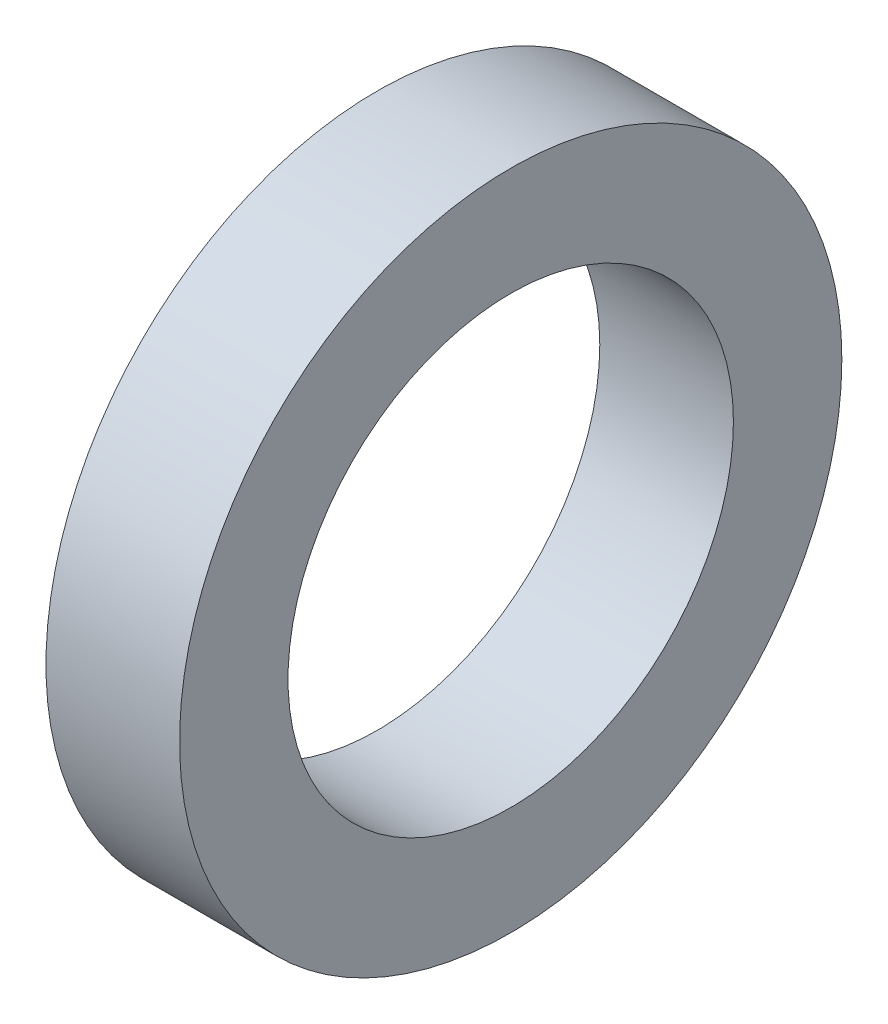
ISO-10303-21;
HEADER;
FILE_DESCRIPTION(('STEP AP214'),'2;1');
FILE_NAME('part.step','',(''),(''),'','','');
FILE_SCHEMA(('AUTOMOTIVE_DESIGN { 1 0 10303 214 1 1 1 1 }'));
ENDSEC;
DATA;
#1=APPLICATION_CONTEXT('core data for automotive mechanical design processes');
#2=APPLICATION_PROTOCOL_DEFINITION('international standard','automotive_design',2000,#1);
#3=PRODUCT_CONTEXT('',#1,'mechanical');
#4=PRODUCT('Part','Part','',(#3));
#5=PRODUCT_RELATED_PRODUCT_CATEGORY('part','',(#4));
#6=PRODUCT_DEFINITION_FORMATION('','',#4);
#7=PRODUCT_DEFINITION_CONTEXT('part definition',#1,'design');
#8=PRODUCT_DEFINITION('design','',#6,#7);
#9=PRODUCT_DEFINITION_SHAPE('','',#8);
#10=(LENGTH_UNIT() NAMED_UNIT(*) SI_UNIT(.MILLI.,.METRE.));
#11=(NAMED_UNIT(*) PLANE_ANGLE_UNIT() SI_UNIT($,.RADIAN.));
#12=(NAMED_UNIT(*) SI_UNIT($,.STERADIAN.) SOLID_ANGLE_UNIT());
#13=UNCERTAINTY_MEASURE_WITH_UNIT(LENGTH_MEASURE(1.E-05),#10,'distance_accuracy_value','');
#14=(GEOMETRIC_REPRESENTATION_CONTEXT(3) GLOBAL_UNCERTAINTY_ASSIGNED_CONTEXT((#13)) GLOBAL_UNIT_ASSIGNED_CONTEXT((#10,
#11,#12)) REPRESENTATION_CONTEXT('',''));
#15=CARTESIAN_POINT('',(0.,0.,0.));
#16=DIRECTION('',(0.,0.,1.));
#17=DIRECTION('',(1.,0.,0.));
#18=AXIS2_PLACEMENT_3D('',#15,#16,#17);
#19=CARTESIAN_POINT('',(9.525,0.,0.));
#20=DIRECTION('',(1.,0.,0.));
#21=DIRECTION('',(0.,0.,-1.));
#22=AXIS2_PLACEMENT_3D('',#19,#20,#21);
#23=PLANE('',#22);
#24=CARTESIAN_POINT('',(9.525,0.,0.));
#25=DIRECTION('',(1.,0.,0.));
#26=DIRECTION('',(0.,0.,-1.));
#27=AXIS2_PLACEMENT_3D('',#24,#25,#26);
#28=CIRCLE('',#27,47.21225);
#29=CARTESIAN_POINT('',(9.525,0.,-47.21225));
#30=VERTEX_POINT('',#29);
#31=EDGE_CURVE('E10',#30,#30,#28,.T.);
#32=ORIENTED_EDGE('',*,*,#31,.T.);
#33=EDGE_LOOP('',(#32));
#34=FACE_BOUND('',#33,.T.);
#35=CARTESIAN_POINT('',(9.525,0.,0.));
#36=DIRECTION('',(1.,0.,0.));
#37=DIRECTION('',(0.,0.,-1.));
#38=AXIS2_PLACEMENT_3D('',#35,#36,#37);
#39=CIRCLE('',#38,31.75);
#40=CARTESIAN_POINT('',(9.525,0.,-31.75));
#41=VERTEX_POINT('',#40);
#42=EDGE_CURVE('E54',#41,#41,#39,.T.);
#43=ORIENTED_EDGE('',*,*,#42,.F.);
#44=EDGE_LOOP('',(#43));
#45=FACE_BOUND('',#44,.T.);
#46=ADVANCED_FACE('F41',(#34,#45),#23,.T.);
#47=CARTESIAN_POINT('',(-9.525,0.,0.));
#48=DIRECTION('',(1.,0.,0.));
#49=DIRECTION('',(0.,0.,-1.));
#50=AXIS2_PLACEMENT_3D('',#47,#48,#49);
#51=PLANE('',#50);
#52=CARTESIAN_POINT('',(-9.525,0.,0.));
#53=DIRECTION('',(1.,0.,0.));
#54=DIRECTION('',(0.,0.,-1.));
#55=AXIS2_PLACEMENT_3D('',#52,#53,#54);
#56=CIRCLE('',#55,47.21225);
#57=CARTESIAN_POINT('',(-9.525,0.,-47.21225));
#58=VERTEX_POINT('',#57);
#59=EDGE_CURVE('E45',#58,#58,#56,.T.);
#60=ORIENTED_EDGE('',*,*,#59,.F.);
#61=EDGE_LOOP('',(#60));
#62=FACE_BOUND('',#61,.T.);
#63=CARTESIAN_POINT('',(-9.525,0.,0.));
#64=DIRECTION('',(1.,0.,0.));
#65=DIRECTION('',(0.,0.,-1.));
#66=AXIS2_PLACEMENT_3D('',#63,#64,#65);
#67=CIRCLE('',#66,31.75);
#68=CARTESIAN_POINT('',(-9.525,0.,-31.75));
#69=VERTEX_POINT('',#68);
#70=EDGE_CURVE('E56',#69,#69,#67,.T.);
#71=ORIENTED_EDGE('',*,*,#70,.T.);
#72=EDGE_LOOP('',(#71));
#73=FACE_BOUND('',#72,.T.);
#74=ADVANCED_FACE('F68',(#62,#73),#51,.F.);
#75=CARTESIAN_POINT('',(9.525,0.,0.));
#76=DIRECTION('',(-1.,0.,0.));
#77=DIRECTION('',(0.,0.,1.));
#78=AXIS2_PLACEMENT_3D('',#75,#76,#77);
#79=CYLINDRICAL_SURFACE('',#78,47.21225);
#80=ORIENTED_EDGE('',*,*,#31,.F.);
#81=EDGE_LOOP('',(#80));
#82=FACE_BOUND('',#81,.T.);
#83=ORIENTED_EDGE('',*,*,#59,.T.);
#84=EDGE_LOOP('',(#83));
#85=FACE_BOUND('',#84,.T.);
#86=ADVANCED_FACE('F43',(#82,#85),#79,.T.);
#87=CARTESIAN_POINT('',(9.525,0.,0.));
#88=DIRECTION('',(-1.,0.,0.));
#89=DIRECTION('',(0.,0.,1.));
#90=AXIS2_PLACEMENT_3D('',#87,#88,#89);
#91=CYLINDRICAL_SURFACE('',#90,31.75);
#92=ORIENTED_EDGE('',*,*,#42,.T.);
#93=EDGE_LOOP('',(#92));
#94=FACE_BOUND('',#93,.T.);
#95=ORIENTED_EDGE('',*,*,#70,.F.);
#96=EDGE_LOOP('',(#95));
#97=FACE_BOUND('',#96,.T.);
#98=ADVANCED_FACE('F64',(#94,#97),#91,.F.);
#99=CLOSED_SHELL('',(#46,#74,#86,#98));
#100=MANIFOLD_SOLID_BREP('B2',#99);
#101=ADVANCED_BREP_SHAPE_REPRESENTATION('',(#18,#100),#14);
#102=SHAPE_DEFINITION_REPRESENTATION(#9,#101);
ENDSEC;
END-ISO-10303-21;
